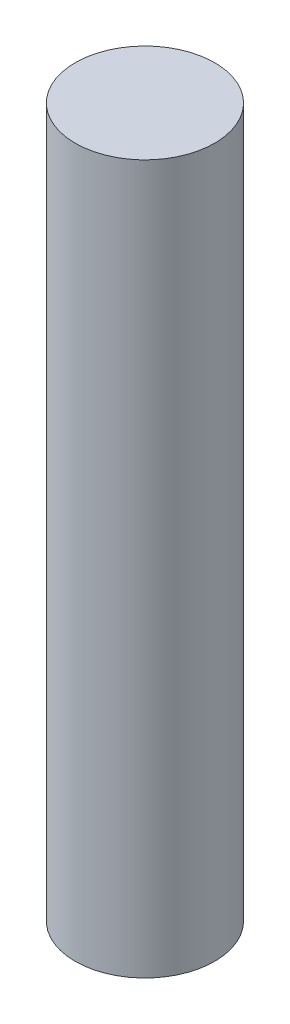
ISO-10303-21;
HEADER;
FILE_DESCRIPTION(('STEP AP214'),'2;1');
FILE_NAME('part.step','',(''),(''),'','','');
FILE_SCHEMA(('AUTOMOTIVE_DESIGN { 1 0 10303 214 1 1 1 1 }'));
ENDSEC;
DATA;
#1=APPLICATION_CONTEXT('core data for automotive mechanical design processes');
#2=APPLICATION_PROTOCOL_DEFINITION('international standard','automotive_design',2000,#1);
#3=PRODUCT_CONTEXT('',#1,'mechanical');
#4=PRODUCT('Part','Part','',(#3));
#5=PRODUCT_RELATED_PRODUCT_CATEGORY('part','',(#4));
#6=PRODUCT_DEFINITION_FORMATION('','',#4);
#7=PRODUCT_DEFINITION_CONTEXT('part definition',#1,'design');
#8=PRODUCT_DEFINITION('design','',#6,#7);
#9=PRODUCT_DEFINITION_SHAPE('','',#8);
#10=(LENGTH_UNIT() NAMED_UNIT(*) SI_UNIT(.MILLI.,.METRE.));
#11=(NAMED_UNIT(*) PLANE_ANGLE_UNIT() SI_UNIT($,.RADIAN.));
#12=(NAMED_UNIT(*) SI_UNIT($,.STERADIAN.) SOLID_ANGLE_UNIT());
#13=UNCERTAINTY_MEASURE_WITH_UNIT(LENGTH_MEASURE(1.E-05),#10,'distance_accuracy_value','');
#14=(GEOMETRIC_REPRESENTATION_CONTEXT(3) GLOBAL_UNCERTAINTY_ASSIGNED_CONTEXT((#13)) GLOBAL_UNIT_ASSIGNED_CONTEXT((#10,
#11,#12)) REPRESENTATION_CONTEXT('',''));
#15=CARTESIAN_POINT('',(0.,0.,0.));
#16=DIRECTION('',(0.,0.,1.));
#17=DIRECTION('',(1.,0.,0.));
#18=AXIS2_PLACEMENT_3D('',#15,#16,#17);
#19=CARTESIAN_POINT('',(0.,96.,0.));
#20=DIRECTION('',(0.,-1.,0.));
#21=DIRECTION('',(0.,0.,-1.));
#22=AXIS2_PLACEMENT_3D('',#19,#20,#21);
#23=CYLINDRICAL_SURFACE('',#22,9.45);
#24=CARTESIAN_POINT('',(0.,96.,0.));
#25=DIRECTION('',(0.,1.,0.));
#26=DIRECTION('',(0.,0.,1.));
#27=AXIS2_PLACEMENT_3D('',#24,#25,#26);
#28=CIRCLE('',#27,9.45);
#29=CARTESIAN_POINT('',(0.,96.,9.45));
#30=VERTEX_POINT('',#29);
#31=EDGE_CURVE('E10',#30,#30,#28,.T.);
#32=ORIENTED_EDGE('',*,*,#31,.F.);
#33=EDGE_LOOP('',(#32));
#34=FACE_BOUND('',#33,.T.);
#35=CARTESIAN_POINT('',(0.,0.,0.));
#36=DIRECTION('',(0.,1.,0.));
#37=DIRECTION('',(0.,0.,1.));
#38=AXIS2_PLACEMENT_3D('',#35,#36,#37);
#39=CIRCLE('',#38,9.45);
#40=CARTESIAN_POINT('',(0.,0.,9.45));
#41=VERTEX_POINT('',#40);
#42=EDGE_CURVE('E34',#41,#41,#39,.T.);
#43=ORIENTED_EDGE('',*,*,#42,.T.);
#44=EDGE_LOOP('',(#43));
#45=FACE_BOUND('',#44,.T.);
#46=ADVANCED_FACE('F31',(#34,#45),#23,.T.);
#47=CARTESIAN_POINT('',(0.,96.,0.));
#48=DIRECTION('',(0.,1.,0.));
#49=DIRECTION('',(0.,0.,1.));
#50=AXIS2_PLACEMENT_3D('',#47,#48,#49);
#51=PLANE('',#50);
#52=ORIENTED_EDGE('',*,*,#31,.T.);
#53=EDGE_LOOP('',(#52));
#54=FACE_BOUND('',#53,.T.);
#55=ADVANCED_FACE('F46',(#54),#51,.T.);
#56=CARTESIAN_POINT('',(0.,0.,0.));
#57=DIRECTION('',(0.,1.,0.));
#58=DIRECTION('',(0.,0.,1.));
#59=AXIS2_PLACEMENT_3D('',#56,#57,#58);
#60=PLANE('',#59);
#61=ORIENTED_EDGE('',*,*,#42,.F.);
#62=EDGE_LOOP('',(#61));
#63=FACE_BOUND('',#62,.T.);
#64=ADVANCED_FACE('F44',(#63),#60,.F.);
#65=CLOSED_SHELL('',(#46,#55,#64));
#66=MANIFOLD_SOLID_BREP('B2',#65);
#67=ADVANCED_BREP_SHAPE_REPRESENTATION('',(#18,#66),#14);
#68=SHAPE_DEFINITION_REPRESENTATION(#9,#67);
ENDSEC;
END-ISO-10303-21;
